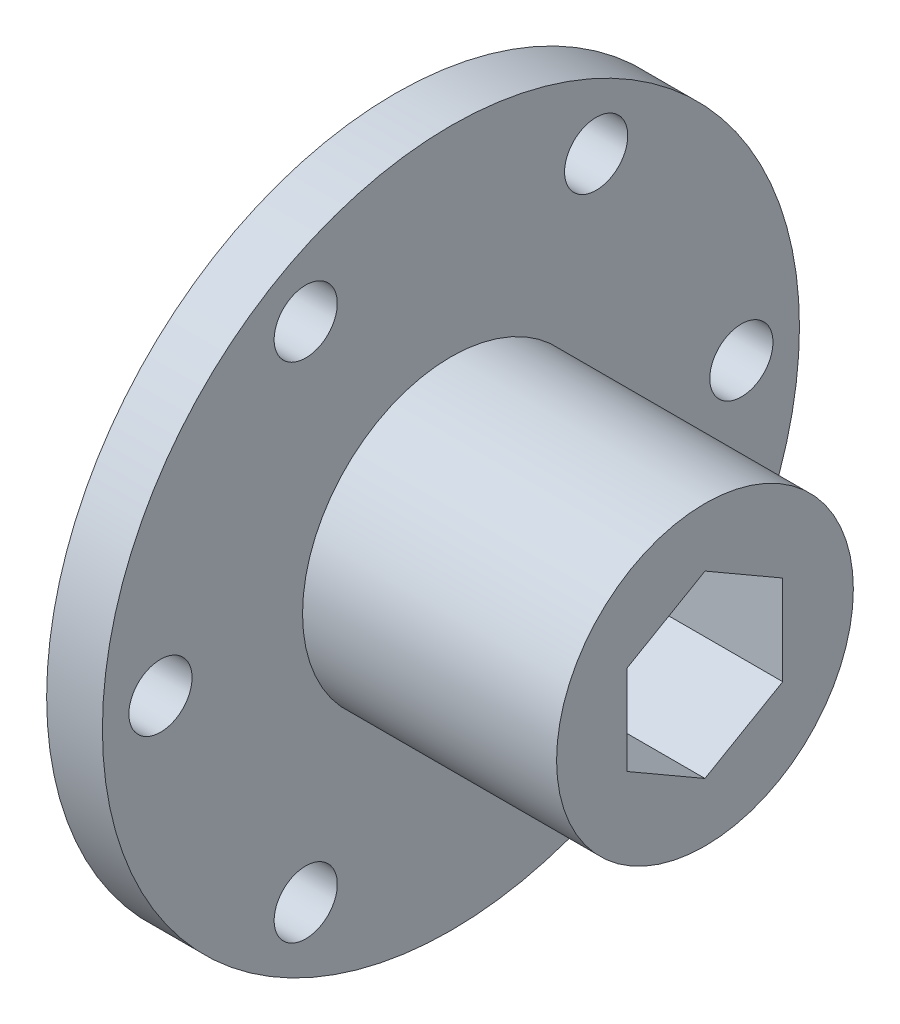
ISO-10303-21;
HEADER;
FILE_DESCRIPTION(('STEP AP214'),'2;1');
FILE_NAME('part.step','',(''),(''),'','','');
FILE_SCHEMA(('AUTOMOTIVE_DESIGN { 1 0 10303 214 1 1 1 1 }'));
ENDSEC;
DATA;
#1=APPLICATION_CONTEXT('core data for automotive mechanical design processes');
#2=APPLICATION_PROTOCOL_DEFINITION('international standard','automotive_design',2000,#1);
#3=PRODUCT_CONTEXT('',#1,'mechanical');
#4=PRODUCT('Part','Part','',(#3));
#5=PRODUCT_RELATED_PRODUCT_CATEGORY('part','',(#4));
#6=PRODUCT_DEFINITION_FORMATION('','',#4);
#7=PRODUCT_DEFINITION_CONTEXT('part definition',#1,'design');
#8=PRODUCT_DEFINITION('design','',#6,#7);
#9=PRODUCT_DEFINITION_SHAPE('','',#8);
#10=(LENGTH_UNIT() NAMED_UNIT(*) SI_UNIT(.MILLI.,.METRE.));
#11=(NAMED_UNIT(*) PLANE_ANGLE_UNIT() SI_UNIT($,.RADIAN.));
#12=(NAMED_UNIT(*) SI_UNIT($,.STERADIAN.) SOLID_ANGLE_UNIT());
#13=UNCERTAINTY_MEASURE_WITH_UNIT(LENGTH_MEASURE(1.E-05),#10,'distance_accuracy_value','');
#14=(GEOMETRIC_REPRESENTATION_CONTEXT(3) GLOBAL_UNCERTAINTY_ASSIGNED_CONTEXT((#13)) GLOBAL_UNIT_ASSIGNED_CONTEXT((#10,
#11,#12)) REPRESENTATION_CONTEXT('',''));
#15=CARTESIAN_POINT('',(0.,0.,0.));
#16=DIRECTION('',(0.,0.,1.));
#17=DIRECTION('',(1.,0.,0.));
#18=AXIS2_PLACEMENT_3D('',#15,#16,#17);
#19=CARTESIAN_POINT('',(-17.6070662460568,0.,0.));
#20=DIRECTION('',(1.,0.,0.));
#21=DIRECTION('',(0.,0.,-1.));
#22=AXIS2_PLACEMENT_3D('',#19,#20,#21);
#23=CYLINDRICAL_SURFACE('',#22,12.1666);
#24=CARTESIAN_POINT('',(7.79293375394323,0.,0.));
#25=DIRECTION('',(1.,0.,0.));
#26=DIRECTION('',(0.,0.,-1.));
#27=AXIS2_PLACEMENT_3D('',#24,#25,#26);
#28=CIRCLE('',#27,12.1666);
#29=CARTESIAN_POINT('',(7.79293375394323,0.,-12.1666));
#30=VERTEX_POINT('',#29);
#31=EDGE_CURVE('E139',#30,#30,#28,.F.);
#32=ORIENTED_EDGE('',*,*,#31,.T.);
#33=EDGE_LOOP('',(#32));
#34=FACE_BOUND('',#33,.T.);
#35=CARTESIAN_POINT('',(-13.0350662460568,0.,0.));
#36=DIRECTION('',(1.,0.,0.));
#37=DIRECTION('',(0.,0.,-1.));
#38=AXIS2_PLACEMENT_3D('',#35,#36,#37);
#39=CIRCLE('',#38,12.1666);
#40=CARTESIAN_POINT('',(-13.0350662460568,0.,-12.1666));
#41=VERTEX_POINT('',#40);
#42=EDGE_CURVE('E20',#41,#41,#39,.T.);
#43=ORIENTED_EDGE('',*,*,#42,.T.);
#44=EDGE_LOOP('',(#43));
#45=FACE_BOUND('',#44,.T.);
#46=ADVANCED_FACE('F17',(#34,#45),#23,.T.);
#47=CARTESIAN_POINT('',(-13.0350662460568,0.,12.1666));
#48=DIRECTION('',(-1.,0.,0.));
#49=DIRECTION('',(0.,0.,1.));
#50=AXIS2_PLACEMENT_3D('',#47,#48,#49);
#51=PLANE('',#50);
#52=ORIENTED_EDGE('',*,*,#42,.F.);
#53=EDGE_LOOP('',(#52));
#54=FACE_BOUND('',#53,.T.);
#55=CARTESIAN_POINT('',(-13.0350662460568,-20.6222299276169,11.90625));
#56=DIRECTION('',(-1.,0.,0.));
#57=DIRECTION('',(0.,0.,1.));
#58=AXIS2_PLACEMENT_3D('',#55,#56,#57);
#59=CIRCLE('',#58,2.5908);
#60=CARTESIAN_POINT('',(-13.0350662460568,-20.6222299276169,14.49705));
#61=VERTEX_POINT('',#60);
#62=EDGE_CURVE('E90',#61,#61,#59,.T.);
#63=ORIENTED_EDGE('',*,*,#62,.T.);
#64=EDGE_LOOP('',(#63));
#65=FACE_BOUND('',#64,.T.);
#66=CARTESIAN_POINT('',(-13.0350662460568,0.,23.8125));
#67=DIRECTION('',(-1.,0.,0.));
#68=DIRECTION('',(0.,0.,1.));
#69=AXIS2_PLACEMENT_3D('',#66,#67,#68);
#70=CIRCLE('',#69,2.5908);
#71=CARTESIAN_POINT('',(-13.0350662460568,0.,26.4033));
#72=VERTEX_POINT('',#71);
#73=EDGE_CURVE('E122',#72,#72,#70,.T.);
#74=ORIENTED_EDGE('',*,*,#73,.T.);
#75=EDGE_LOOP('',(#74));
#76=FACE_BOUND('',#75,.T.);
#77=CARTESIAN_POINT('',(-13.0350662460568,20.6222299276169,11.90625));
#78=DIRECTION('',(-1.,0.,0.));
#79=DIRECTION('',(0.,0.,1.));
#80=AXIS2_PLACEMENT_3D('',#77,#78,#79);
#81=CIRCLE('',#80,2.5908);
#82=CARTESIAN_POINT('',(-13.0350662460568,20.6222299276169,14.49705));
#83=VERTEX_POINT('',#82);
#84=EDGE_CURVE('E125',#83,#83,#81,.T.);
#85=ORIENTED_EDGE('',*,*,#84,.T.);
#86=EDGE_LOOP('',(#85));
#87=FACE_BOUND('',#86,.T.);
#88=CARTESIAN_POINT('',(-13.0350662460568,20.6222299276169,-11.90625));
#89=DIRECTION('',(-1.,0.,0.));
#90=DIRECTION('',(0.,0.,1.));
#91=AXIS2_PLACEMENT_3D('',#88,#89,#90);
#92=CIRCLE('',#91,2.5908);
#93=CARTESIAN_POINT('',(-13.0350662460568,20.6222299276169,-9.31545));
#94=VERTEX_POINT('',#93);
#95=EDGE_CURVE('E128',#94,#94,#92,.T.);
#96=ORIENTED_EDGE('',*,*,#95,.T.);
#97=EDGE_LOOP('',(#96));
#98=FACE_BOUND('',#97,.T.);
#99=CARTESIAN_POINT('',(-13.0350662460568,0.,-23.8125));
#100=DIRECTION('',(-1.,0.,0.));
#101=DIRECTION('',(0.,0.,1.));
#102=AXIS2_PLACEMENT_3D('',#99,#100,#101);
#103=CIRCLE('',#102,2.5908);
#104=CARTESIAN_POINT('',(-13.0350662460568,0.,-21.2217));
#105=VERTEX_POINT('',#104);
#106=EDGE_CURVE('E131',#105,#105,#103,.T.);
#107=ORIENTED_EDGE('',*,*,#106,.T.);
#108=EDGE_LOOP('',(#107));
#109=FACE_BOUND('',#108,.T.);
#110=CARTESIAN_POINT('',(-13.0350662460568,-20.6222299276169,-11.90625));
#111=DIRECTION('',(-1.,0.,0.));
#112=DIRECTION('',(0.,0.,1.));
#113=AXIS2_PLACEMENT_3D('',#110,#111,#112);
#114=CIRCLE('',#113,2.5908);
#115=CARTESIAN_POINT('',(-13.0350662460568,-20.6222299276169,-9.31545));
#116=VERTEX_POINT('',#115);
#117=EDGE_CURVE('E134',#116,#116,#114,.T.);
#118=ORIENTED_EDGE('',*,*,#117,.T.);
#119=EDGE_LOOP('',(#118));
#120=FACE_BOUND('',#119,.T.);
#121=CARTESIAN_POINT('',(-13.0350662460568,0.,0.));
#122=DIRECTION('',(1.,0.,0.));
#123=DIRECTION('',(0.,0.,-1.));
#124=AXIS2_PLACEMENT_3D('',#121,#122,#123);
#125=CIRCLE('',#124,28.575);
#126=CARTESIAN_POINT('',(-13.0350662460568,0.,-28.575));
#127=VERTEX_POINT('',#126);
#128=EDGE_CURVE('E137',#127,#127,#125,.F.);
#129=ORIENTED_EDGE('',*,*,#128,.F.);
#130=EDGE_LOOP('',(#129));
#131=FACE_BOUND('',#130,.T.);
#132=ADVANCED_FACE('F147',(#54,#65,#76,#87,#98,#109,#120,#131),#51,.F.);
#133=CARTESIAN_POINT('',(7.79293375394323,0.,0.));
#134=DIRECTION('',(-1.,0.,0.));
#135=DIRECTION('',(0.,0.,1.));
#136=AXIS2_PLACEMENT_3D('',#133,#134,#135);
#137=PLANE('',#136);
#138=DIRECTION('',(0.,1.,0.));
#139=VECTOR('',#138,1.);
#140=CARTESIAN_POINT('',(7.79293375394323,-3.68085890619154,6.3754));
#141=LINE('',#140,#139);
#142=CARTESIAN_POINT('',(7.79293375394323,3.68081890619155,6.3754));
#143=VERTEX_POINT('',#142);
#144=CARTESIAN_POINT('',(7.79293375394323,-3.68085890619154,6.3754));
#145=VERTEX_POINT('',#144);
#146=EDGE_CURVE('E80',#143,#145,#141,.F.);
#147=ORIENTED_EDGE('',*,*,#146,.F.);
#148=DIRECTION('',(0.,0.500000000000001,-0.866025403784438));
#149=VECTOR('',#148,1.);
#150=CARTESIAN_POINT('',(7.79293375394323,3.68081890619153,6.3754));
#151=LINE('',#150,#149);
#152=CARTESIAN_POINT('',(7.79293375394323,7.36165781238309,0.));
#153=VERTEX_POINT('',#152);
#154=EDGE_CURVE('E71',#153,#143,#151,.F.);
#155=ORIENTED_EDGE('',*,*,#154,.F.);
#156=DIRECTION('',(0.,-0.500000000000001,-0.866025403784438));
#157=VECTOR('',#156,1.);
#158=CARTESIAN_POINT('',(7.79293375394323,7.3616578123831,0.));
#159=LINE('',#158,#157);
#160=CARTESIAN_POINT('',(7.79293375394323,3.68081890619156,-6.3754));
#161=VERTEX_POINT('',#160);
#162=EDGE_CURVE('E66',#161,#153,#159,.F.);
#163=ORIENTED_EDGE('',*,*,#162,.F.);
#164=DIRECTION('',(0.,1.,0.));
#165=VECTOR('',#164,1.);
#166=CARTESIAN_POINT('',(7.79293375394323,3.68081890619156,-6.3754));
#167=LINE('',#166,#165);
#168=CARTESIAN_POINT('',(7.79293375394323,-3.68085890619154,-6.3754));
#169=VERTEX_POINT('',#168);
#170=EDGE_CURVE('E350',#169,#161,#167,.T.);
#171=ORIENTED_EDGE('',*,*,#170,.F.);
#172=DIRECTION('',(0.,-0.500000000000001,0.866025403784438));
#173=VECTOR('',#172,1.);
#174=CARTESIAN_POINT('',(7.79293375394323,-3.68085890619154,-6.3754));
#175=LINE('',#174,#173);
#176=CARTESIAN_POINT('',(7.79293375394323,-7.36169781238309,0.));
#177=VERTEX_POINT('',#176);
#178=EDGE_CURVE('E359',#177,#169,#175,.F.);
#179=ORIENTED_EDGE('',*,*,#178,.F.);
#180=DIRECTION('',(0.,0.5,0.866025403784438));
#181=VECTOR('',#180,1.);
#182=CARTESIAN_POINT('',(7.79293375394323,-7.36169781238308,0.));
#183=LINE('',#182,#181);
#184=EDGE_CURVE('E86',#145,#177,#183,.F.);
#185=ORIENTED_EDGE('',*,*,#184,.F.);
#186=EDGE_LOOP('',(#147,#155,#163,#171,#179,#185));
#187=FACE_BOUND('',#186,.T.);
#188=ORIENTED_EDGE('',*,*,#31,.F.);
#189=EDGE_LOOP('',(#188));
#190=FACE_BOUND('',#189,.T.);
#191=ADVANCED_FACE('F83',(#187,#190),#137,.F.);
#192=CARTESIAN_POINT('',(-17.6070662460568,0.,0.));
#193=DIRECTION('',(1.,0.,0.));
#194=DIRECTION('',(0.,0.,-1.));
#195=AXIS2_PLACEMENT_3D('',#192,#193,#194);
#196=CYLINDRICAL_SURFACE('',#195,28.575);
#197=ORIENTED_EDGE('',*,*,#128,.T.);
#198=EDGE_LOOP('',(#197));
#199=FACE_BOUND('',#198,.T.);
#200=CARTESIAN_POINT('',(-17.6070662460568,0.,0.));
#201=DIRECTION('',(1.,0.,0.));
#202=DIRECTION('',(0.,0.,-1.));
#203=AXIS2_PLACEMENT_3D('',#200,#201,#202);
#204=CIRCLE('',#203,28.575);
#205=CARTESIAN_POINT('',(-17.6070662460568,0.,-28.575));
#206=VERTEX_POINT('',#205);
#207=EDGE_CURVE('E117',#206,#206,#204,.T.);
#208=ORIENTED_EDGE('',*,*,#207,.T.);
#209=EDGE_LOOP('',(#208));
#210=FACE_BOUND('',#209,.T.);
#211=ADVANCED_FACE('F164',(#199,#210),#196,.T.);
#212=CARTESIAN_POINT('',(-97.7546330532591,-20.6222299276169,-11.90625));
#213=DIRECTION('',(-1.,0.,0.));
#214=DIRECTION('',(0.,0.,1.));
#215=AXIS2_PLACEMENT_3D('',#212,#213,#214);
#216=CYLINDRICAL_SURFACE('',#215,2.5908);
#217=ORIENTED_EDGE('',*,*,#117,.F.);
#218=EDGE_LOOP('',(#217));
#219=FACE_BOUND('',#218,.T.);
#220=CARTESIAN_POINT('',(-17.6070662460568,-20.6222299276169,-11.90625));
#221=DIRECTION('',(-1.,0.,0.));
#222=DIRECTION('',(0.,0.,1.));
#223=AXIS2_PLACEMENT_3D('',#220,#221,#222);
#224=CIRCLE('',#223,2.5908);
#225=CARTESIAN_POINT('',(-17.6070662460568,-20.6222299276169,-9.31545));
#226=VERTEX_POINT('',#225);
#227=EDGE_CURVE('E114',#226,#226,#224,.T.);
#228=ORIENTED_EDGE('',*,*,#227,.T.);
#229=EDGE_LOOP('',(#228));
#230=FACE_BOUND('',#229,.T.);
#231=ADVANCED_FACE('F167',(#219,#230),#216,.F.);
#232=CARTESIAN_POINT('',(-97.7546330532591,0.,-23.8125));
#233=DIRECTION('',(-1.,0.,0.));
#234=DIRECTION('',(0.,0.,1.));
#235=AXIS2_PLACEMENT_3D('',#232,#233,#234);
#236=CYLINDRICAL_SURFACE('',#235,2.5908);
#237=ORIENTED_EDGE('',*,*,#106,.F.);
#238=EDGE_LOOP('',(#237));
#239=FACE_BOUND('',#238,.T.);
#240=CARTESIAN_POINT('',(-17.6070662460568,0.,-23.8125));
#241=DIRECTION('',(-1.,0.,0.));
#242=DIRECTION('',(0.,0.,1.));
#243=AXIS2_PLACEMENT_3D('',#240,#241,#242);
#244=CIRCLE('',#243,2.5908);
#245=CARTESIAN_POINT('',(-17.6070662460568,0.,-21.2217));
#246=VERTEX_POINT('',#245);
#247=EDGE_CURVE('E111',#246,#246,#244,.T.);
#248=ORIENTED_EDGE('',*,*,#247,.T.);
#249=EDGE_LOOP('',(#248));
#250=FACE_BOUND('',#249,.T.);
#251=ADVANCED_FACE('F214',(#239,#250),#236,.F.);
#252=CARTESIAN_POINT('',(-97.7546330532591,20.6222299276169,-11.90625));
#253=DIRECTION('',(-1.,0.,0.));
#254=DIRECTION('',(0.,0.,1.));
#255=AXIS2_PLACEMENT_3D('',#252,#253,#254);
#256=CYLINDRICAL_SURFACE('',#255,2.5908);
#257=ORIENTED_EDGE('',*,*,#95,.F.);
#258=EDGE_LOOP('',(#257));
#259=FACE_BOUND('',#258,.T.);
#260=CARTESIAN_POINT('',(-17.6070662460568,20.6222299276169,-11.90625));
#261=DIRECTION('',(-1.,0.,0.));
#262=DIRECTION('',(0.,0.,1.));
#263=AXIS2_PLACEMENT_3D('',#260,#261,#262);
#264=CIRCLE('',#263,2.5908);
#265=CARTESIAN_POINT('',(-17.6070662460568,20.6222299276169,-9.31545));
#266=VERTEX_POINT('',#265);
#267=EDGE_CURVE('E108',#266,#266,#264,.T.);
#268=ORIENTED_EDGE('',*,*,#267,.T.);
#269=EDGE_LOOP('',(#268));
#270=FACE_BOUND('',#269,.T.);
#271=ADVANCED_FACE('F210',(#259,#270),#256,.F.);
#272=CARTESIAN_POINT('',(-97.7546330532591,20.6222299276169,11.90625));
#273=DIRECTION('',(-1.,0.,0.));
#274=DIRECTION('',(0.,0.,1.));
#275=AXIS2_PLACEMENT_3D('',#272,#273,#274);
#276=CYLINDRICAL_SURFACE('',#275,2.5908);
#277=ORIENTED_EDGE('',*,*,#84,.F.);
#278=EDGE_LOOP('',(#277));
#279=FACE_BOUND('',#278,.T.);
#280=CARTESIAN_POINT('',(-17.6070662460568,20.6222299276169,11.90625));
#281=DIRECTION('',(-1.,0.,0.));
#282=DIRECTION('',(0.,0.,1.));
#283=AXIS2_PLACEMENT_3D('',#280,#281,#282);
#284=CIRCLE('',#283,2.5908);
#285=CARTESIAN_POINT('',(-17.6070662460568,20.6222299276169,14.49705));
#286=VERTEX_POINT('',#285);
#287=EDGE_CURVE('E105',#286,#286,#284,.T.);
#288=ORIENTED_EDGE('',*,*,#287,.T.);
#289=EDGE_LOOP('',(#288));
#290=FACE_BOUND('',#289,.T.);
#291=ADVANCED_FACE('F206',(#279,#290),#276,.F.);
#292=CARTESIAN_POINT('',(-97.7546330532591,0.,23.8125));
#293=DIRECTION('',(-1.,0.,0.));
#294=DIRECTION('',(0.,0.,1.));
#295=AXIS2_PLACEMENT_3D('',#292,#293,#294);
#296=CYLINDRICAL_SURFACE('',#295,2.5908);
#297=ORIENTED_EDGE('',*,*,#73,.F.);
#298=EDGE_LOOP('',(#297));
#299=FACE_BOUND('',#298,.T.);
#300=CARTESIAN_POINT('',(-17.6070662460568,0.,23.8125));
#301=DIRECTION('',(-1.,0.,0.));
#302=DIRECTION('',(0.,0.,1.));
#303=AXIS2_PLACEMENT_3D('',#300,#301,#302);
#304=CIRCLE('',#303,2.5908);
#305=CARTESIAN_POINT('',(-17.6070662460568,0.,26.4033));
#306=VERTEX_POINT('',#305);
#307=EDGE_CURVE('E102',#306,#306,#304,.T.);
#308=ORIENTED_EDGE('',*,*,#307,.T.);
#309=EDGE_LOOP('',(#308));
#310=FACE_BOUND('',#309,.T.);
#311=ADVANCED_FACE('F202',(#299,#310),#296,.F.);
#312=CARTESIAN_POINT('',(-97.7546330532591,-20.6222299276169,11.90625));
#313=DIRECTION('',(-1.,0.,0.));
#314=DIRECTION('',(0.,0.,1.));
#315=AXIS2_PLACEMENT_3D('',#312,#313,#314);
#316=CYLINDRICAL_SURFACE('',#315,2.5908);
#317=ORIENTED_EDGE('',*,*,#62,.F.);
#318=EDGE_LOOP('',(#317));
#319=FACE_BOUND('',#318,.T.);
#320=CARTESIAN_POINT('',(-17.6070662460568,-20.6222299276169,11.90625));
#321=DIRECTION('',(-1.,0.,0.));
#322=DIRECTION('',(0.,0.,1.));
#323=AXIS2_PLACEMENT_3D('',#320,#321,#322);
#324=CIRCLE('',#323,2.5908);
#325=CARTESIAN_POINT('',(-17.6070662460568,-20.6222299276169,14.49705));
#326=VERTEX_POINT('',#325);
#327=EDGE_CURVE('E99',#326,#326,#324,.T.);
#328=ORIENTED_EDGE('',*,*,#327,.T.);
#329=EDGE_LOOP('',(#328));
#330=FACE_BOUND('',#329,.T.);
#331=ADVANCED_FACE('F199',(#319,#330),#316,.F.);
#332=CARTESIAN_POINT('',(-76.9266330532591,-3.68085890619154,6.3754));
#333=DIRECTION('',(0.,0.,-1.));
#334=DIRECTION('',(-1.,0.,0.));
#335=AXIS2_PLACEMENT_3D('',#332,#333,#334);
#336=PLANE('',#335);
#337=ORIENTED_EDGE('',*,*,#146,.T.);
#338=DIRECTION('',(1.,0.,0.));
#339=VECTOR('',#338,1.);
#340=CARTESIAN_POINT('',(-76.9266330532591,-3.68085890619154,6.3754));
#341=LINE('',#340,#339);
#342=CARTESIAN_POINT('',(-17.6070662460568,-3.68085890619154,6.3754));
#343=VERTEX_POINT('',#342);
#344=EDGE_CURVE('E372',#343,#145,#341,.T.);
#345=ORIENTED_EDGE('',*,*,#344,.F.);
#346=DIRECTION('',(0.,1.,0.));
#347=VECTOR('',#346,1.);
#348=CARTESIAN_POINT('',(-17.6070662460568,0.,6.3754));
#349=LINE('',#348,#347);
#350=CARTESIAN_POINT('',(-17.6070662460568,3.68081890619155,6.3754));
#351=VERTEX_POINT('',#350);
#352=EDGE_CURVE('E94',#343,#351,#349,.T.);
#353=ORIENTED_EDGE('',*,*,#352,.T.);
#354=DIRECTION('',(1.,0.,0.));
#355=VECTOR('',#354,1.);
#356=CARTESIAN_POINT('',(-76.9266330532591,3.68081890619154,6.37539999999999));
#357=LINE('',#356,#355);
#358=EDGE_CURVE('E76',#143,#351,#357,.F.);
#359=ORIENTED_EDGE('',*,*,#358,.F.);
#360=EDGE_LOOP('',(#337,#345,#353,#359));
#361=FACE_BOUND('',#360,.T.);
#362=ADVANCED_FACE('F93',(#361),#336,.T.);
#363=CARTESIAN_POINT('',(-76.9266330532591,3.68081890619153,6.3754));
#364=DIRECTION('',(0.,-0.866025403784438,-0.500000000000001));
#365=DIRECTION('',(0.,0.500000000000001,-0.866025403784438));
#366=AXIS2_PLACEMENT_3D('',#363,#364,#365);
#367=PLANE('',#366);
#368=ORIENTED_EDGE('',*,*,#154,.T.);
#369=ORIENTED_EDGE('',*,*,#358,.T.);
#370=DIRECTION('',(0.,0.5,-0.866025403784438));
#371=VECTOR('',#370,1.);
#372=CARTESIAN_POINT('',(-17.6070662460568,3.68081890619156,6.3754));
#373=LINE('',#372,#371);
#374=CARTESIAN_POINT('',(-17.6070662460568,7.36165781238309,0.));
#375=VERTEX_POINT('',#374);
#376=EDGE_CURVE('E363',#351,#375,#373,.T.);
#377=ORIENTED_EDGE('',*,*,#376,.T.);
#378=DIRECTION('',(1.,0.,0.));
#379=VECTOR('',#378,1.);
#380=CARTESIAN_POINT('',(-76.9266330532591,7.3616578123831,0.));
#381=LINE('',#380,#379);
#382=EDGE_CURVE('E78',#153,#375,#381,.F.);
#383=ORIENTED_EDGE('',*,*,#382,.F.);
#384=EDGE_LOOP('',(#368,#369,#377,#383));
#385=FACE_BOUND('',#384,.T.);
#386=ADVANCED_FACE('F73',(#385),#367,.T.);
#387=CARTESIAN_POINT('',(-76.9266330532591,7.3616578123831,0.));
#388=DIRECTION('',(0.,-0.866025403784438,0.500000000000001));
#389=DIRECTION('',(0.,-0.500000000000001,-0.866025403784438));
#390=AXIS2_PLACEMENT_3D('',#387,#388,#389);
#391=PLANE('',#390);
#392=ORIENTED_EDGE('',*,*,#162,.T.);
#393=ORIENTED_EDGE('',*,*,#382,.T.);
#394=DIRECTION('',(0.,-0.499999999999999,-0.866025403784439));
#395=VECTOR('',#394,1.);
#396=CARTESIAN_POINT('',(-17.6070662460568,7.3616578123831,0.));
#397=LINE('',#396,#395);
#398=CARTESIAN_POINT('',(-17.6070662460568,3.68081890619155,-6.3754));
#399=VERTEX_POINT('',#398);
#400=EDGE_CURVE('E358',#375,#399,#397,.T.);
#401=ORIENTED_EDGE('',*,*,#400,.T.);
#402=DIRECTION('',(1.,0.,0.));
#403=VECTOR('',#402,1.);
#404=CARTESIAN_POINT('',(-76.9266330532591,3.68081890619156,-6.3754));
#405=LINE('',#404,#403);
#406=EDGE_CURVE('E352',#161,#399,#405,.F.);
#407=ORIENTED_EDGE('',*,*,#406,.F.);
#408=EDGE_LOOP('',(#392,#393,#401,#407));
#409=FACE_BOUND('',#408,.T.);
#410=ADVANCED_FACE('F191',(#409),#391,.T.);
#411=CARTESIAN_POINT('',(-76.9266330532591,3.68081890619156,-6.3754));
#412=DIRECTION('',(0.,0.,1.));
#413=DIRECTION('',(1.,0.,0.));
#414=AXIS2_PLACEMENT_3D('',#411,#412,#413);
#415=PLANE('',#414);
#416=ORIENTED_EDGE('',*,*,#170,.T.);
#417=ORIENTED_EDGE('',*,*,#406,.T.);
#418=DIRECTION('',(0.,1.,0.));
#419=VECTOR('',#418,1.);
#420=CARTESIAN_POINT('',(-17.6070662460568,0.,-6.3754));
#421=LINE('',#420,#419);
#422=CARTESIAN_POINT('',(-17.6070662460568,-3.68085890619154,-6.3754));
#423=VERTEX_POINT('',#422);
#424=EDGE_CURVE('E364',#399,#423,#421,.F.);
#425=ORIENTED_EDGE('',*,*,#424,.T.);
#426=DIRECTION('',(1.,0.,0.));
#427=VECTOR('',#426,1.);
#428=CARTESIAN_POINT('',(-76.9266330532591,-3.68085890619154,-6.3754));
#429=LINE('',#428,#427);
#430=EDGE_CURVE('E354',#169,#423,#429,.F.);
#431=ORIENTED_EDGE('',*,*,#430,.F.);
#432=EDGE_LOOP('',(#416,#417,#425,#431));
#433=FACE_BOUND('',#432,.T.);
#434=ADVANCED_FACE('F187',(#433),#415,.T.);
#435=CARTESIAN_POINT('',(-76.9266330532591,-3.68085890619154,-6.3754));
#436=DIRECTION('',(0.,0.866025403784438,0.500000000000001));
#437=DIRECTION('',(0.,-0.500000000000001,0.866025403784438));
#438=AXIS2_PLACEMENT_3D('',#435,#436,#437);
#439=PLANE('',#438);
#440=ORIENTED_EDGE('',*,*,#178,.T.);
#441=ORIENTED_EDGE('',*,*,#430,.T.);
#442=DIRECTION('',(0.,-0.499999999999999,0.866025403784439));
#443=VECTOR('',#442,1.);
#444=CARTESIAN_POINT('',(-17.6070662460568,-3.68085890619154,-6.3754));
#445=LINE('',#444,#443);
#446=CARTESIAN_POINT('',(-17.6070662460568,-7.36169781238309,0.));
#447=VERTEX_POINT('',#446);
#448=EDGE_CURVE('E26',#423,#447,#445,.T.);
#449=ORIENTED_EDGE('',*,*,#448,.T.);
#450=DIRECTION('',(1.,0.,0.));
#451=VECTOR('',#450,1.);
#452=CARTESIAN_POINT('',(-76.9266330532591,-7.36169781238308,0.));
#453=LINE('',#452,#451);
#454=EDGE_CURVE('E34',#177,#447,#453,.F.);
#455=ORIENTED_EDGE('',*,*,#454,.F.);
#456=EDGE_LOOP('',(#440,#441,#449,#455));
#457=FACE_BOUND('',#456,.T.);
#458=ADVANCED_FACE('F180',(#457),#439,.T.);
#459=CARTESIAN_POINT('',(-76.9266330532591,-7.36169781238308,0.));
#460=DIRECTION('',(0.,0.866025403784438,-0.5));
#461=DIRECTION('',(0.,0.5,0.866025403784438));
#462=AXIS2_PLACEMENT_3D('',#459,#460,#461);
#463=PLANE('',#462);
#464=ORIENTED_EDGE('',*,*,#184,.T.);
#465=ORIENTED_EDGE('',*,*,#454,.T.);
#466=DIRECTION('',(0.,0.5,0.866025403784439));
#467=VECTOR('',#466,1.);
#468=CARTESIAN_POINT('',(-17.6070662460568,-7.36169781238308,0.));
#469=LINE('',#468,#467);
#470=EDGE_CURVE('E11',#447,#343,#469,.T.);
#471=ORIENTED_EDGE('',*,*,#470,.T.);
#472=ORIENTED_EDGE('',*,*,#344,.T.);
#473=EDGE_LOOP('',(#464,#465,#471,#472));
#474=FACE_BOUND('',#473,.T.);
#475=ADVANCED_FACE('F173',(#474),#463,.T.);
#476=CARTESIAN_POINT('',(-17.6070662460568,0.,28.575));
#477=DIRECTION('',(1.,0.,0.));
#478=DIRECTION('',(0.,0.,-1.));
#479=AXIS2_PLACEMENT_3D('',#476,#477,#478);
#480=PLANE('',#479);
#481=ORIENTED_EDGE('',*,*,#448,.F.);
#482=ORIENTED_EDGE('',*,*,#424,.F.);
#483=ORIENTED_EDGE('',*,*,#400,.F.);
#484=ORIENTED_EDGE('',*,*,#376,.F.);
#485=ORIENTED_EDGE('',*,*,#352,.F.);
#486=ORIENTED_EDGE('',*,*,#470,.F.);
#487=EDGE_LOOP('',(#481,#482,#483,#484,#485,#486));
#488=FACE_BOUND('',#487,.T.);
#489=ORIENTED_EDGE('',*,*,#327,.F.);
#490=EDGE_LOOP('',(#489));
#491=FACE_BOUND('',#490,.T.);
#492=ORIENTED_EDGE('',*,*,#307,.F.);
#493=EDGE_LOOP('',(#492));
#494=FACE_BOUND('',#493,.T.);
#495=ORIENTED_EDGE('',*,*,#287,.F.);
#496=EDGE_LOOP('',(#495));
#497=FACE_BOUND('',#496,.T.);
#498=ORIENTED_EDGE('',*,*,#267,.F.);
#499=EDGE_LOOP('',(#498));
#500=FACE_BOUND('',#499,.T.);
#501=ORIENTED_EDGE('',*,*,#247,.F.);
#502=EDGE_LOOP('',(#501));
#503=FACE_BOUND('',#502,.T.);
#504=ORIENTED_EDGE('',*,*,#227,.F.);
#505=EDGE_LOOP('',(#504));
#506=FACE_BOUND('',#505,.T.);
#507=ORIENTED_EDGE('',*,*,#207,.F.);
#508=EDGE_LOOP('',(#507));
#509=FACE_BOUND('',#508,.T.);
#510=ADVANCED_FACE('F171',(#488,#491,#494,#497,#500,#503,#506,#509),#480,.F.);
#511=CLOSED_SHELL('',(#46,#132,#191,#211,#231,#251,#271,#291,#311,#331,#362,#386,#410,#434,#458,
#475,#510));
#512=MANIFOLD_SOLID_BREP('B1',#511);
#513=ADVANCED_BREP_SHAPE_REPRESENTATION('',(#18,#512),#14);
#514=SHAPE_DEFINITION_REPRESENTATION(#9,#513);
ENDSEC;
END-ISO-10303-21;
